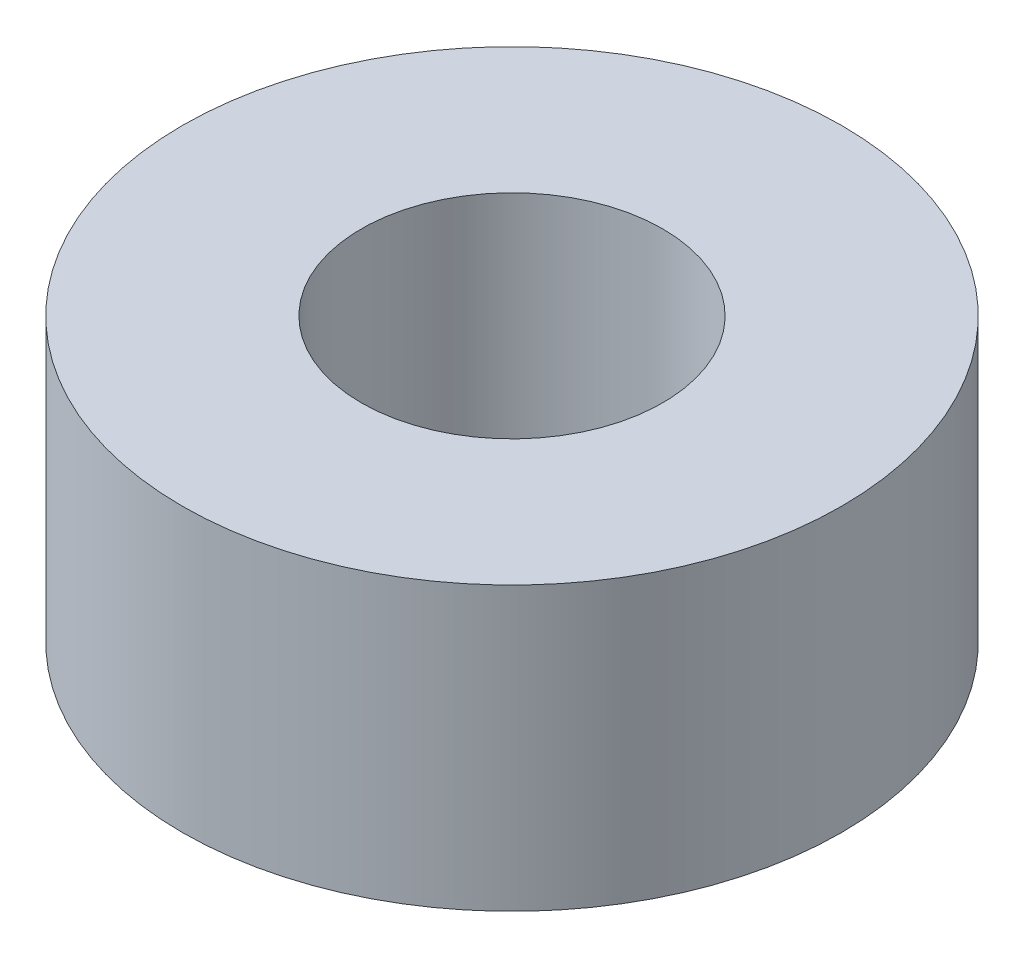
ISO-10303-21;
HEADER;
FILE_DESCRIPTION(('STEP AP214'),'2;1');
FILE_NAME('part.step','',(''),(''),'','','');
FILE_SCHEMA(('AUTOMOTIVE_DESIGN { 1 0 10303 214 1 1 1 1 }'));
ENDSEC;
DATA;
#1=APPLICATION_CONTEXT('core data for automotive mechanical design processes');
#2=APPLICATION_PROTOCOL_DEFINITION('international standard','automotive_design',2000,#1);
#3=PRODUCT_CONTEXT('',#1,'mechanical');
#4=PRODUCT('Part','Part','',(#3));
#5=PRODUCT_RELATED_PRODUCT_CATEGORY('part','',(#4));
#6=PRODUCT_DEFINITION_FORMATION('','',#4);
#7=PRODUCT_DEFINITION_CONTEXT('part definition',#1,'design');
#8=PRODUCT_DEFINITION('design','',#6,#7);
#9=PRODUCT_DEFINITION_SHAPE('','',#8);
#10=(LENGTH_UNIT() NAMED_UNIT(*) SI_UNIT(.MILLI.,.METRE.));
#11=(NAMED_UNIT(*) PLANE_ANGLE_UNIT() SI_UNIT($,.RADIAN.));
#12=(NAMED_UNIT(*) SI_UNIT($,.STERADIAN.) SOLID_ANGLE_UNIT());
#13=UNCERTAINTY_MEASURE_WITH_UNIT(LENGTH_MEASURE(1.E-05),#10,'distance_accuracy_value','');
#14=(GEOMETRIC_REPRESENTATION_CONTEXT(3) GLOBAL_UNCERTAINTY_ASSIGNED_CONTEXT((#13)) GLOBAL_UNIT_ASSIGNED_CONTEXT((#10,
#11,#12)) REPRESENTATION_CONTEXT('',''));
#15=CARTESIAN_POINT('',(0.,0.,0.));
#16=DIRECTION('',(0.,0.,1.));
#17=DIRECTION('',(1.,0.,0.));
#18=AXIS2_PLACEMENT_3D('',#15,#16,#17);
#19=CARTESIAN_POINT('',(0.,3.,0.));
#20=DIRECTION('',(0.,-1.,0.));
#21=DIRECTION('',(0.,0.,-1.));
#22=AXIS2_PLACEMENT_3D('',#19,#20,#21);
#23=CYLINDRICAL_SURFACE('',#22,3.5);
#24=CARTESIAN_POINT('',(0.,3.,0.));
#25=DIRECTION('',(0.,1.,0.));
#26=DIRECTION('',(0.,0.,1.));
#27=AXIS2_PLACEMENT_3D('',#24,#25,#26);
#28=CIRCLE('',#27,3.5);
#29=CARTESIAN_POINT('',(0.,3.,3.5));
#30=VERTEX_POINT('',#29);
#31=EDGE_CURVE('E10',#30,#30,#28,.T.);
#32=ORIENTED_EDGE('',*,*,#31,.F.);
#33=EDGE_LOOP('',(#32));
#34=FACE_BOUND('',#33,.T.);
#35=CARTESIAN_POINT('',(0.,0.,0.));
#36=DIRECTION('',(0.,1.,0.));
#37=DIRECTION('',(0.,0.,1.));
#38=AXIS2_PLACEMENT_3D('',#35,#36,#37);
#39=CIRCLE('',#38,3.5);
#40=CARTESIAN_POINT('',(0.,0.,3.5));
#41=VERTEX_POINT('',#40);
#42=EDGE_CURVE('E34',#41,#41,#39,.T.);
#43=ORIENTED_EDGE('',*,*,#42,.T.);
#44=EDGE_LOOP('',(#43));
#45=FACE_BOUND('',#44,.T.);
#46=ADVANCED_FACE('F31',(#34,#45),#23,.T.);
#47=CARTESIAN_POINT('',(0.,3.,0.));
#48=DIRECTION('',(0.,1.,0.));
#49=DIRECTION('',(0.,0.,1.));
#50=AXIS2_PLACEMENT_3D('',#47,#48,#49);
#51=PLANE('',#50);
#52=CARTESIAN_POINT('',(0.,3.,0.));
#53=DIRECTION('',(0.,1.,0.));
#54=DIRECTION('',(0.,0.,1.));
#55=AXIS2_PLACEMENT_3D('',#52,#53,#54);
#56=CIRCLE('',#55,1.6);
#57=CARTESIAN_POINT('',(0.,3.,1.6));
#58=VERTEX_POINT('',#57);
#59=EDGE_CURVE('E43',#58,#58,#56,.T.);
#60=ORIENTED_EDGE('',*,*,#59,.F.);
#61=EDGE_LOOP('',(#60));
#62=FACE_BOUND('',#61,.T.);
#63=ORIENTED_EDGE('',*,*,#31,.T.);
#64=EDGE_LOOP('',(#63));
#65=FACE_BOUND('',#64,.T.);
#66=ADVANCED_FACE('F58',(#62,#65),#51,.T.);
#67=CARTESIAN_POINT('',(0.,0.,0.));
#68=DIRECTION('',(0.,1.,0.));
#69=DIRECTION('',(0.,0.,1.));
#70=AXIS2_PLACEMENT_3D('',#67,#68,#69);
#71=PLANE('',#70);
#72=CARTESIAN_POINT('',(0.,0.,0.));
#73=DIRECTION('',(0.,1.,0.));
#74=DIRECTION('',(0.,0.,1.));
#75=AXIS2_PLACEMENT_3D('',#72,#73,#74);
#76=CIRCLE('',#75,1.6);
#77=CARTESIAN_POINT('',(0.,0.,1.6));
#78=VERTEX_POINT('',#77);
#79=EDGE_CURVE('E41',#78,#78,#76,.T.);
#80=ORIENTED_EDGE('',*,*,#79,.T.);
#81=EDGE_LOOP('',(#80));
#82=FACE_BOUND('',#81,.T.);
#83=ORIENTED_EDGE('',*,*,#42,.F.);
#84=EDGE_LOOP('',(#83));
#85=FACE_BOUND('',#84,.T.);
#86=ADVANCED_FACE('F49',(#82,#85),#71,.F.);
#87=CARTESIAN_POINT('',(0.,0.,0.));
#88=DIRECTION('',(0.,1.,0.));
#89=DIRECTION('',(0.,0.,1.));
#90=AXIS2_PLACEMENT_3D('',#87,#88,#89);
#91=CYLINDRICAL_SURFACE('',#90,1.6);
#92=ORIENTED_EDGE('',*,*,#79,.F.);
#93=EDGE_LOOP('',(#92));
#94=FACE_BOUND('',#93,.T.);
#95=ORIENTED_EDGE('',*,*,#59,.T.);
#96=EDGE_LOOP('',(#95));
#97=FACE_BOUND('',#96,.T.);
#98=ADVANCED_FACE('F52',(#94,#97),#91,.F.);
#99=CLOSED_SHELL('',(#46,#66,#86,#98));
#100=MANIFOLD_SOLID_BREP('B2',#99);
#101=ADVANCED_BREP_SHAPE_REPRESENTATION('',(#18,#100),#14);
#102=SHAPE_DEFINITION_REPRESENTATION(#9,#101);
ENDSEC;
END-ISO-10303-21;
